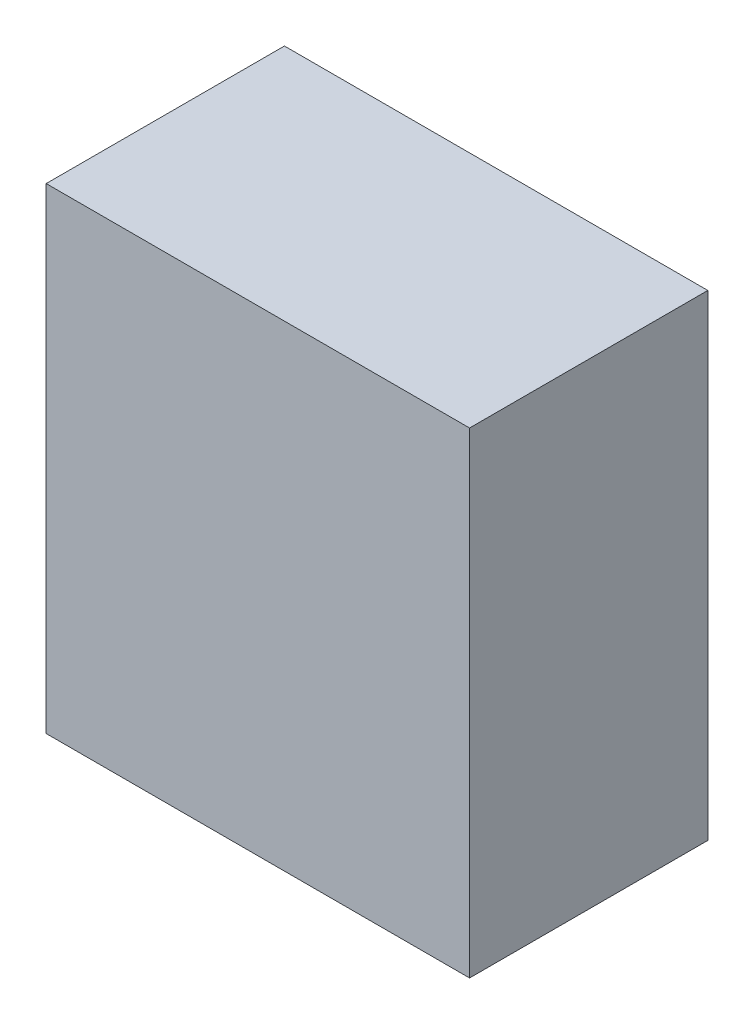
ISO-10303-21;
HEADER;
FILE_DESCRIPTION(('STEP AP214'),'2;1');
FILE_NAME('part.step','',(''),(''),'','','');
FILE_SCHEMA(('AUTOMOTIVE_DESIGN { 1 0 10303 214 1 1 1 1 }'));
ENDSEC;
DATA;
#1=APPLICATION_CONTEXT('core data for automotive mechanical design processes');
#2=APPLICATION_PROTOCOL_DEFINITION('international standard','automotive_design',2000,#1);
#3=PRODUCT_CONTEXT('',#1,'mechanical');
#4=PRODUCT('Part','Part','',(#3));
#5=PRODUCT_RELATED_PRODUCT_CATEGORY('part','',(#4));
#6=PRODUCT_DEFINITION_FORMATION('','',#4);
#7=PRODUCT_DEFINITION_CONTEXT('part definition',#1,'design');
#8=PRODUCT_DEFINITION('design','',#6,#7);
#9=PRODUCT_DEFINITION_SHAPE('','',#8);
#10=(LENGTH_UNIT() NAMED_UNIT(*) SI_UNIT(.MILLI.,.METRE.));
#11=(NAMED_UNIT(*) PLANE_ANGLE_UNIT() SI_UNIT($,.RADIAN.));
#12=(NAMED_UNIT(*) SI_UNIT($,.STERADIAN.) SOLID_ANGLE_UNIT());
#13=UNCERTAINTY_MEASURE_WITH_UNIT(LENGTH_MEASURE(1.E-05),#10,'distance_accuracy_value','');
#14=(GEOMETRIC_REPRESENTATION_CONTEXT(3) GLOBAL_UNCERTAINTY_ASSIGNED_CONTEXT((#13)) GLOBAL_UNIT_ASSIGNED_CONTEXT((#10,
#11,#12)) REPRESENTATION_CONTEXT('',''));
#15=CARTESIAN_POINT('',(0.,0.,0.));
#16=DIRECTION('',(0.,0.,1.));
#17=DIRECTION('',(1.,0.,0.));
#18=AXIS2_PLACEMENT_3D('',#15,#16,#17);
#19=CARTESIAN_POINT('',(0.,0.,1.34999984));
#20=DIRECTION('',(0.,0.,-1.));
#21=DIRECTION('',(-1.,0.,0.));
#22=AXIS2_PLACEMENT_3D('',#19,#20,#21);
#23=PLANE('',#22);
#24=DIRECTION('',(0.,1.,0.));
#25=VECTOR('',#24,1.);
#26=CARTESIAN_POINT('',(1.19949468,1.34949184,1.34999984));
#27=LINE('',#26,#25);
#28=CARTESIAN_POINT('',(1.19949468,1.34949184,1.34999984));
#29=VERTEX_POINT('',#28);
#30=CARTESIAN_POINT('',(1.19949468,-1.34949184,1.34999984));
#31=VERTEX_POINT('',#30);
#32=EDGE_CURVE('E68',#29,#31,#27,.F.);
#33=ORIENTED_EDGE('',*,*,#32,.F.);
#34=DIRECTION('',(1.,0.,0.));
#35=VECTOR('',#34,1.);
#36=CARTESIAN_POINT('',(-1.19949468,1.34949184,1.34999984));
#37=LINE('',#36,#35);
#38=CARTESIAN_POINT('',(-1.19949468,1.34949184,1.34999984));
#39=VERTEX_POINT('',#38);
#40=EDGE_CURVE('E55',#39,#29,#37,.T.);
#41=ORIENTED_EDGE('',*,*,#40,.F.);
#42=DIRECTION('',(0.,1.,0.));
#43=VECTOR('',#42,1.);
#44=CARTESIAN_POINT('',(-1.19949468,-1.34949184,1.34999984));
#45=LINE('',#44,#43);
#46=CARTESIAN_POINT('',(-1.19949468,-1.34949184,1.34999984));
#47=VERTEX_POINT('',#46);
#48=EDGE_CURVE('E20',#47,#39,#45,.T.);
#49=ORIENTED_EDGE('',*,*,#48,.F.);
#50=DIRECTION('',(1.,0.,0.));
#51=VECTOR('',#50,1.);
#52=CARTESIAN_POINT('',(1.19949468,-1.34949184,1.34999984));
#53=LINE('',#52,#51);
#54=EDGE_CURVE('E80',#31,#47,#53,.F.);
#55=ORIENTED_EDGE('',*,*,#54,.F.);
#56=EDGE_LOOP('',(#33,#41,#49,#55));
#57=FACE_BOUND('',#56,.T.);
#58=ADVANCED_FACE('F17',(#57),#23,.F.);
#59=CARTESIAN_POINT('',(-1.19949468,-1.34949184,0.));
#60=DIRECTION('',(-1.,0.,0.));
#61=DIRECTION('',(0.,0.,1.));
#62=AXIS2_PLACEMENT_3D('',#59,#60,#61);
#63=PLANE('',#62);
#64=DIRECTION('',(0.,0.,1.));
#65=VECTOR('',#64,1.);
#66=CARTESIAN_POINT('',(-1.19949468,1.34949184,0.));
#67=LINE('',#66,#65);
#68=CARTESIAN_POINT('',(-1.19949468,1.34949184,0.));
#69=VERTEX_POINT('',#68);
#70=EDGE_CURVE('E61',#69,#39,#67,.T.);
#71=ORIENTED_EDGE('',*,*,#70,.F.);
#72=DIRECTION('',(0.,1.,0.));
#73=VECTOR('',#72,1.);
#74=CARTESIAN_POINT('',(-1.19949468,0.,0.));
#75=LINE('',#74,#73);
#76=CARTESIAN_POINT('',(-1.19949468,-1.34949184,0.));
#77=VERTEX_POINT('',#76);
#78=EDGE_CURVE('E83',#77,#69,#75,.T.);
#79=ORIENTED_EDGE('',*,*,#78,.F.);
#80=DIRECTION('',(0.,0.,-1.));
#81=VECTOR('',#80,1.);
#82=CARTESIAN_POINT('',(-1.19949468,-1.34949184,0.));
#83=LINE('',#82,#81);
#84=EDGE_CURVE('E64',#47,#77,#83,.T.);
#85=ORIENTED_EDGE('',*,*,#84,.F.);
#86=ORIENTED_EDGE('',*,*,#48,.T.);
#87=EDGE_LOOP('',(#71,#79,#85,#86));
#88=FACE_BOUND('',#87,.T.);
#89=ADVANCED_FACE('F60',(#88),#63,.T.);
#90=CARTESIAN_POINT('',(-1.19949468,1.34949184,0.));
#91=DIRECTION('',(0.,1.,0.));
#92=DIRECTION('',(0.,0.,1.));
#93=AXIS2_PLACEMENT_3D('',#90,#91,#92);
#94=PLANE('',#93);
#95=DIRECTION('',(0.,0.,-1.));
#96=VECTOR('',#95,1.);
#97=CARTESIAN_POINT('',(1.19949468,1.34949184,0.));
#98=LINE('',#97,#96);
#99=CARTESIAN_POINT('',(1.19949468,1.34949184,0.));
#100=VERTEX_POINT('',#99);
#101=EDGE_CURVE('E70',#100,#29,#98,.F.);
#102=ORIENTED_EDGE('',*,*,#101,.F.);
#103=DIRECTION('',(-1.,0.,0.));
#104=VECTOR('',#103,1.);
#105=CARTESIAN_POINT('',(0.,1.34949184,0.));
#106=LINE('',#105,#104);
#107=EDGE_CURVE('E74',#69,#100,#106,.F.);
#108=ORIENTED_EDGE('',*,*,#107,.F.);
#109=ORIENTED_EDGE('',*,*,#70,.T.);
#110=ORIENTED_EDGE('',*,*,#40,.T.);
#111=EDGE_LOOP('',(#102,#108,#109,#110));
#112=FACE_BOUND('',#111,.T.);
#113=ADVANCED_FACE('F72',(#112),#94,.T.);
#114=CARTESIAN_POINT('',(1.19949468,1.34949184,0.));
#115=DIRECTION('',(1.,0.,0.));
#116=DIRECTION('',(0.,0.,-1.));
#117=AXIS2_PLACEMENT_3D('',#114,#115,#116);
#118=PLANE('',#117);
#119=DIRECTION('',(0.,0.,-1.));
#120=VECTOR('',#119,1.);
#121=CARTESIAN_POINT('',(1.19949468,-1.34949184,0.));
#122=LINE('',#121,#120);
#123=CARTESIAN_POINT('',(1.19949468,-1.34949184,0.));
#124=VERTEX_POINT('',#123);
#125=EDGE_CURVE('E35',#124,#31,#122,.F.);
#126=ORIENTED_EDGE('',*,*,#125,.F.);
#127=DIRECTION('',(0.,1.,0.));
#128=VECTOR('',#127,1.);
#129=CARTESIAN_POINT('',(1.19949468,0.,0.));
#130=LINE('',#129,#128);
#131=EDGE_CURVE('E26',#100,#124,#130,.F.);
#132=ORIENTED_EDGE('',*,*,#131,.F.);
#133=ORIENTED_EDGE('',*,*,#101,.T.);
#134=ORIENTED_EDGE('',*,*,#32,.T.);
#135=EDGE_LOOP('',(#126,#132,#133,#134));
#136=FACE_BOUND('',#135,.T.);
#137=ADVANCED_FACE('F89',(#136),#118,.T.);
#138=CARTESIAN_POINT('',(1.19949468,-1.34949184,0.));
#139=DIRECTION('',(0.,-1.,0.));
#140=DIRECTION('',(0.,0.,-1.));
#141=AXIS2_PLACEMENT_3D('',#138,#139,#140);
#142=PLANE('',#141);
#143=ORIENTED_EDGE('',*,*,#84,.T.);
#144=DIRECTION('',(-1.,0.,0.));
#145=VECTOR('',#144,1.);
#146=CARTESIAN_POINT('',(0.,-1.34949184,0.));
#147=LINE('',#146,#145);
#148=EDGE_CURVE('E11',#124,#77,#147,.T.);
#149=ORIENTED_EDGE('',*,*,#148,.F.);
#150=ORIENTED_EDGE('',*,*,#125,.T.);
#151=ORIENTED_EDGE('',*,*,#54,.T.);
#152=EDGE_LOOP('',(#143,#149,#150,#151));
#153=FACE_BOUND('',#152,.T.);
#154=ADVANCED_FACE('F91',(#153),#142,.T.);
#155=CARTESIAN_POINT('',(0.,0.,0.));
#156=DIRECTION('',(0.,0.,-1.));
#157=DIRECTION('',(-1.,0.,0.));
#158=AXIS2_PLACEMENT_3D('',#155,#156,#157);
#159=PLANE('',#158);
#160=ORIENTED_EDGE('',*,*,#131,.T.);
#161=ORIENTED_EDGE('',*,*,#148,.T.);
#162=ORIENTED_EDGE('',*,*,#78,.T.);
#163=ORIENTED_EDGE('',*,*,#107,.T.);
#164=EDGE_LOOP('',(#160,#161,#162,#163));
#165=FACE_BOUND('',#164,.T.);
#166=ADVANCED_FACE('F88',(#165),#159,.T.);
#167=CLOSED_SHELL('',(#58,#89,#113,#137,#154,#166));
#168=MANIFOLD_SOLID_BREP('B1',#167);
#169=ADVANCED_BREP_SHAPE_REPRESENTATION('',(#18,#168),#14);
#170=SHAPE_DEFINITION_REPRESENTATION(#9,#169);
ENDSEC;
END-ISO-10303-21;
